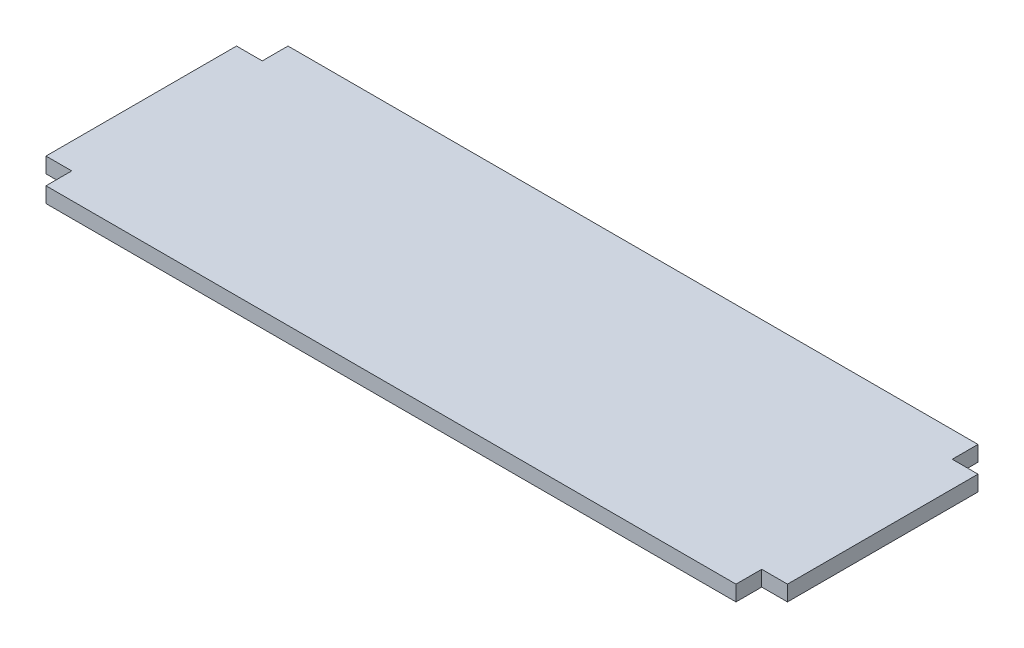
ISO-10303-21;
HEADER;
FILE_DESCRIPTION(('STEP AP214'),'2;1');
FILE_NAME('part.step','',(''),(''),'','','');
FILE_SCHEMA(('AUTOMOTIVE_DESIGN { 1 0 10303 214 1 1 1 1 }'));
ENDSEC;
DATA;
#1=APPLICATION_CONTEXT('core data for automotive mechanical design processes');
#2=APPLICATION_PROTOCOL_DEFINITION('international standard','automotive_design',2000,#1);
#3=PRODUCT_CONTEXT('',#1,'mechanical');
#4=PRODUCT('Part','Part','',(#3));
#5=PRODUCT_RELATED_PRODUCT_CATEGORY('part','',(#4));
#6=PRODUCT_DEFINITION_FORMATION('','',#4);
#7=PRODUCT_DEFINITION_CONTEXT('part definition',#1,'design');
#8=PRODUCT_DEFINITION('design','',#6,#7);
#9=PRODUCT_DEFINITION_SHAPE('','',#8);
#10=(LENGTH_UNIT() NAMED_UNIT(*) SI_UNIT(.MILLI.,.METRE.));
#11=(NAMED_UNIT(*) PLANE_ANGLE_UNIT() SI_UNIT($,.RADIAN.));
#12=(NAMED_UNIT(*) SI_UNIT($,.STERADIAN.) SOLID_ANGLE_UNIT());
#13=UNCERTAINTY_MEASURE_WITH_UNIT(LENGTH_MEASURE(1.E-05),#10,'distance_accuracy_value','');
#14=(GEOMETRIC_REPRESENTATION_CONTEXT(3) GLOBAL_UNCERTAINTY_ASSIGNED_CONTEXT((#13)) GLOBAL_UNIT_ASSIGNED_CONTEXT((#10,
#11,#12)) REPRESENTATION_CONTEXT('',''));
#15=CARTESIAN_POINT('',(0.,0.,0.));
#16=DIRECTION('',(0.,0.,1.));
#17=DIRECTION('',(1.,0.,0.));
#18=AXIS2_PLACEMENT_3D('',#15,#16,#17);
#19=CARTESIAN_POINT('',(278.,6.,-94.));
#20=DIRECTION('',(-1.,0.,0.));
#21=DIRECTION('',(0.,0.,1.));
#22=AXIS2_PLACEMENT_3D('',#19,#20,#21);
#23=PLANE('',#22);
#24=DIRECTION('',(0.,0.,-1.));
#25=VECTOR('',#24,1.);
#26=CARTESIAN_POINT('',(278.,0.,-94.));
#27=LINE('',#26,#25);
#28=CARTESIAN_POINT('',(278.,0.,-84.));
#29=VERTEX_POINT('',#28);
#30=CARTESIAN_POINT('',(278.,0.,-94.));
#31=VERTEX_POINT('',#30);
#32=EDGE_CURVE('E158',#29,#31,#27,.T.);
#33=ORIENTED_EDGE('',*,*,#32,.T.);
#34=DIRECTION('',(0.,-1.,0.));
#35=VECTOR('',#34,1.);
#36=CARTESIAN_POINT('',(278.,6.,-94.));
#37=LINE('',#36,#35);
#38=CARTESIAN_POINT('',(278.,6.,-94.));
#39=VERTEX_POINT('',#38);
#40=EDGE_CURVE('E11',#39,#31,#37,.T.);
#41=ORIENTED_EDGE('',*,*,#40,.F.);
#42=DIRECTION('',(0.,0.,-1.));
#43=VECTOR('',#42,1.);
#44=CARTESIAN_POINT('',(278.,6.,-94.));
#45=LINE('',#44,#43);
#46=CARTESIAN_POINT('',(278.,6.,-84.));
#47=VERTEX_POINT('',#46);
#48=EDGE_CURVE('E180',#47,#39,#45,.T.);
#49=ORIENTED_EDGE('',*,*,#48,.F.);
#50=DIRECTION('',(0.,-1.,0.));
#51=VECTOR('',#50,1.);
#52=CARTESIAN_POINT('',(278.,6.,-84.));
#53=LINE('',#52,#51);
#54=EDGE_CURVE('E154',#47,#29,#53,.T.);
#55=ORIENTED_EDGE('',*,*,#54,.T.);
#56=EDGE_LOOP('',(#33,#41,#49,#55));
#57=FACE_BOUND('',#56,.T.);
#58=ADVANCED_FACE('F38',(#57),#23,.F.);
#59=CARTESIAN_POINT('',(278.,6.,-94.));
#60=DIRECTION('',(0.,0.,1.));
#61=DIRECTION('',(1.,0.,0.));
#62=AXIS2_PLACEMENT_3D('',#59,#60,#61);
#63=PLANE('',#62);
#64=DIRECTION('',(-1.,0.,0.));
#65=VECTOR('',#64,1.);
#66=CARTESIAN_POINT('',(278.,0.,-94.));
#67=LINE('',#66,#65);
#68=CARTESIAN_POINT('',(10.,0.,-94.));
#69=VERTEX_POINT('',#68);
#70=EDGE_CURVE('E161',#31,#69,#67,.T.);
#71=ORIENTED_EDGE('',*,*,#70,.T.);
#72=DIRECTION('',(0.,-1.,0.));
#73=VECTOR('',#72,1.);
#74=CARTESIAN_POINT('',(10.,6.,-94.));
#75=LINE('',#74,#73);
#76=CARTESIAN_POINT('',(10.,6.,-94.));
#77=VERTEX_POINT('',#76);
#78=EDGE_CURVE('E46',#77,#69,#75,.T.);
#79=ORIENTED_EDGE('',*,*,#78,.F.);
#80=DIRECTION('',(-1.,0.,0.));
#81=VECTOR('',#80,1.);
#82=CARTESIAN_POINT('',(278.,6.,-94.));
#83=LINE('',#82,#81);
#84=EDGE_CURVE('E109',#39,#77,#83,.T.);
#85=ORIENTED_EDGE('',*,*,#84,.F.);
#86=ORIENTED_EDGE('',*,*,#40,.T.);
#87=EDGE_LOOP('',(#71,#79,#85,#86));
#88=FACE_BOUND('',#87,.T.);
#89=ADVANCED_FACE('F258',(#88),#63,.F.);
#90=CARTESIAN_POINT('',(10.,6.,-94.));
#91=DIRECTION('',(1.,0.,0.));
#92=DIRECTION('',(0.,0.,-1.));
#93=AXIS2_PLACEMENT_3D('',#90,#91,#92);
#94=PLANE('',#93);
#95=DIRECTION('',(0.,0.,1.));
#96=VECTOR('',#95,1.);
#97=CARTESIAN_POINT('',(10.,0.,-94.));
#98=LINE('',#97,#96);
#99=CARTESIAN_POINT('',(10.,0.,-84.));
#100=VERTEX_POINT('',#99);
#101=EDGE_CURVE('E163',#69,#100,#98,.T.);
#102=ORIENTED_EDGE('',*,*,#101,.T.);
#103=DIRECTION('',(0.,-1.,0.));
#104=VECTOR('',#103,1.);
#105=CARTESIAN_POINT('',(10.,6.,-84.));
#106=LINE('',#105,#104);
#107=CARTESIAN_POINT('',(10.,6.,-84.));
#108=VERTEX_POINT('',#107);
#109=EDGE_CURVE('E199',#108,#100,#106,.T.);
#110=ORIENTED_EDGE('',*,*,#109,.F.);
#111=DIRECTION('',(0.,0.,1.));
#112=VECTOR('',#111,1.);
#113=CARTESIAN_POINT('',(10.,6.,-94.));
#114=LINE('',#113,#112);
#115=EDGE_CURVE('E207',#77,#108,#114,.T.);
#116=ORIENTED_EDGE('',*,*,#115,.F.);
#117=ORIENTED_EDGE('',*,*,#78,.T.);
#118=EDGE_LOOP('',(#102,#110,#116,#117));
#119=FACE_BOUND('',#118,.T.);
#120=ADVANCED_FACE('F205',(#119),#94,.F.);
#121=CARTESIAN_POINT('',(0.,6.,-84.));
#122=DIRECTION('',(0.,0.,1.));
#123=DIRECTION('',(1.,0.,0.));
#124=AXIS2_PLACEMENT_3D('',#121,#122,#123);
#125=PLANE('',#124);
#126=DIRECTION('',(-1.,0.,0.));
#127=VECTOR('',#126,1.);
#128=CARTESIAN_POINT('',(0.,0.,-84.));
#129=LINE('',#128,#127);
#130=CARTESIAN_POINT('',(0.,0.,-84.));
#131=VERTEX_POINT('',#130);
#132=EDGE_CURVE('E165',#100,#131,#129,.T.);
#133=ORIENTED_EDGE('',*,*,#132,.T.);
#134=DIRECTION('',(0.,-1.,0.));
#135=VECTOR('',#134,1.);
#136=CARTESIAN_POINT('',(0.,6.,-84.));
#137=LINE('',#136,#135);
#138=CARTESIAN_POINT('',(0.,6.,-84.));
#139=VERTEX_POINT('',#138);
#140=EDGE_CURVE('E196',#139,#131,#137,.T.);
#141=ORIENTED_EDGE('',*,*,#140,.F.);
#142=DIRECTION('',(-1.,0.,0.));
#143=VECTOR('',#142,1.);
#144=CARTESIAN_POINT('',(0.,6.,-84.));
#145=LINE('',#144,#143);
#146=EDGE_CURVE('E225',#108,#139,#145,.T.);
#147=ORIENTED_EDGE('',*,*,#146,.F.);
#148=ORIENTED_EDGE('',*,*,#109,.T.);
#149=EDGE_LOOP('',(#133,#141,#147,#148));
#150=FACE_BOUND('',#149,.T.);
#151=ADVANCED_FACE('F216',(#150),#125,.F.);
#152=CARTESIAN_POINT('',(0.,6.,-84.));
#153=DIRECTION('',(1.,0.,0.));
#154=DIRECTION('',(0.,0.,-1.));
#155=AXIS2_PLACEMENT_3D('',#152,#153,#154);
#156=PLANE('',#155);
#157=DIRECTION('',(0.,0.,1.));
#158=VECTOR('',#157,1.);
#159=CARTESIAN_POINT('',(0.,0.,-84.));
#160=LINE('',#159,#158);
#161=CARTESIAN_POINT('',(0.,0.,-10.));
#162=VERTEX_POINT('',#161);
#163=EDGE_CURVE('E167',#131,#162,#160,.T.);
#164=ORIENTED_EDGE('',*,*,#163,.T.);
#165=DIRECTION('',(0.,-1.,0.));
#166=VECTOR('',#165,1.);
#167=CARTESIAN_POINT('',(0.,6.,-10.));
#168=LINE('',#167,#166);
#169=CARTESIAN_POINT('',(0.,6.,-10.));
#170=VERTEX_POINT('',#169);
#171=EDGE_CURVE('E193',#170,#162,#168,.T.);
#172=ORIENTED_EDGE('',*,*,#171,.F.);
#173=DIRECTION('',(0.,0.,1.));
#174=VECTOR('',#173,1.);
#175=CARTESIAN_POINT('',(0.,6.,-84.));
#176=LINE('',#175,#174);
#177=EDGE_CURVE('E222',#139,#170,#176,.T.);
#178=ORIENTED_EDGE('',*,*,#177,.F.);
#179=ORIENTED_EDGE('',*,*,#140,.T.);
#180=EDGE_LOOP('',(#164,#172,#178,#179));
#181=FACE_BOUND('',#180,.T.);
#182=ADVANCED_FACE('F220',(#181),#156,.F.);
#183=CARTESIAN_POINT('',(0.,6.,-10.));
#184=DIRECTION('',(0.,0.,-1.));
#185=DIRECTION('',(-1.,0.,0.));
#186=AXIS2_PLACEMENT_3D('',#183,#184,#185);
#187=PLANE('',#186);
#188=DIRECTION('',(1.,0.,0.));
#189=VECTOR('',#188,1.);
#190=CARTESIAN_POINT('',(0.,0.,-10.));
#191=LINE('',#190,#189);
#192=CARTESIAN_POINT('',(10.,0.,-10.));
#193=VERTEX_POINT('',#192);
#194=EDGE_CURVE('E169',#162,#193,#191,.T.);
#195=ORIENTED_EDGE('',*,*,#194,.T.);
#196=DIRECTION('',(0.,-1.,0.));
#197=VECTOR('',#196,1.);
#198=CARTESIAN_POINT('',(10.,6.,-10.));
#199=LINE('',#198,#197);
#200=CARTESIAN_POINT('',(10.,6.,-10.));
#201=VERTEX_POINT('',#200);
#202=EDGE_CURVE('E190',#201,#193,#199,.T.);
#203=ORIENTED_EDGE('',*,*,#202,.F.);
#204=DIRECTION('',(1.,0.,0.));
#205=VECTOR('',#204,1.);
#206=CARTESIAN_POINT('',(0.,6.,-10.));
#207=LINE('',#206,#205);
#208=EDGE_CURVE('E224',#170,#201,#207,.T.);
#209=ORIENTED_EDGE('',*,*,#208,.F.);
#210=ORIENTED_EDGE('',*,*,#171,.T.);
#211=EDGE_LOOP('',(#195,#203,#209,#210));
#212=FACE_BOUND('',#211,.T.);
#213=ADVANCED_FACE('F271',(#212),#187,.F.);
#214=CARTESIAN_POINT('',(10.,6.,0.));
#215=DIRECTION('',(1.,0.,0.));
#216=DIRECTION('',(0.,0.,-1.));
#217=AXIS2_PLACEMENT_3D('',#214,#215,#216);
#218=PLANE('',#217);
#219=DIRECTION('',(0.,0.,1.));
#220=VECTOR('',#219,1.);
#221=CARTESIAN_POINT('',(10.,0.,0.));
#222=LINE('',#221,#220);
#223=CARTESIAN_POINT('',(10.,0.,0.));
#224=VERTEX_POINT('',#223);
#225=EDGE_CURVE('E171',#193,#224,#222,.T.);
#226=ORIENTED_EDGE('',*,*,#225,.T.);
#227=DIRECTION('',(0.,-1.,0.));
#228=VECTOR('',#227,1.);
#229=CARTESIAN_POINT('',(10.,6.,0.));
#230=LINE('',#229,#228);
#231=CARTESIAN_POINT('',(10.,6.,0.));
#232=VERTEX_POINT('',#231);
#233=EDGE_CURVE('E187',#232,#224,#230,.T.);
#234=ORIENTED_EDGE('',*,*,#233,.F.);
#235=DIRECTION('',(0.,0.,1.));
#236=VECTOR('',#235,1.);
#237=CARTESIAN_POINT('',(10.,6.,0.));
#238=LINE('',#237,#236);
#239=EDGE_CURVE('E227',#201,#232,#238,.T.);
#240=ORIENTED_EDGE('',*,*,#239,.F.);
#241=ORIENTED_EDGE('',*,*,#202,.T.);
#242=EDGE_LOOP('',(#226,#234,#240,#241));
#243=FACE_BOUND('',#242,.T.);
#244=ADVANCED_FACE('F274',(#243),#218,.F.);
#245=CARTESIAN_POINT('',(278.,6.,0.));
#246=DIRECTION('',(0.,0.,-1.));
#247=DIRECTION('',(-1.,0.,0.));
#248=AXIS2_PLACEMENT_3D('',#245,#246,#247);
#249=PLANE('',#248);
#250=DIRECTION('',(1.,0.,0.));
#251=VECTOR('',#250,1.);
#252=CARTESIAN_POINT('',(278.,0.,0.));
#253=LINE('',#252,#251);
#254=CARTESIAN_POINT('',(278.,0.,0.));
#255=VERTEX_POINT('',#254);
#256=EDGE_CURVE('E173',#224,#255,#253,.T.);
#257=ORIENTED_EDGE('',*,*,#256,.T.);
#258=DIRECTION('',(0.,-1.,0.));
#259=VECTOR('',#258,1.);
#260=CARTESIAN_POINT('',(278.,6.,0.));
#261=LINE('',#260,#259);
#262=CARTESIAN_POINT('',(278.,6.,0.));
#263=VERTEX_POINT('',#262);
#264=EDGE_CURVE('E184',#263,#255,#261,.T.);
#265=ORIENTED_EDGE('',*,*,#264,.F.);
#266=DIRECTION('',(1.,0.,0.));
#267=VECTOR('',#266,1.);
#268=CARTESIAN_POINT('',(278.,6.,0.));
#269=LINE('',#268,#267);
#270=EDGE_CURVE('E233',#232,#263,#269,.T.);
#271=ORIENTED_EDGE('',*,*,#270,.F.);
#272=ORIENTED_EDGE('',*,*,#233,.T.);
#273=EDGE_LOOP('',(#257,#265,#271,#272));
#274=FACE_BOUND('',#273,.T.);
#275=ADVANCED_FACE('F239',(#274),#249,.F.);
#276=CARTESIAN_POINT('',(278.,6.,0.));
#277=DIRECTION('',(-1.,0.,0.));
#278=DIRECTION('',(0.,0.,1.));
#279=AXIS2_PLACEMENT_3D('',#276,#277,#278);
#280=PLANE('',#279);
#281=DIRECTION('',(0.,0.,-1.));
#282=VECTOR('',#281,1.);
#283=CARTESIAN_POINT('',(278.,0.,0.));
#284=LINE('',#283,#282);
#285=CARTESIAN_POINT('',(278.,0.,-10.));
#286=VERTEX_POINT('',#285);
#287=EDGE_CURVE('E175',#255,#286,#284,.T.);
#288=ORIENTED_EDGE('',*,*,#287,.T.);
#289=DIRECTION('',(0.,-1.,0.));
#290=VECTOR('',#289,1.);
#291=CARTESIAN_POINT('',(278.,6.,-10.));
#292=LINE('',#291,#290);
#293=CARTESIAN_POINT('',(278.,6.,-10.));
#294=VERTEX_POINT('',#293);
#295=EDGE_CURVE('E149',#294,#286,#292,.T.);
#296=ORIENTED_EDGE('',*,*,#295,.F.);
#297=DIRECTION('',(0.,0.,-1.));
#298=VECTOR('',#297,1.);
#299=CARTESIAN_POINT('',(278.,6.,0.));
#300=LINE('',#299,#298);
#301=EDGE_CURVE('E140',#263,#294,#300,.T.);
#302=ORIENTED_EDGE('',*,*,#301,.F.);
#303=ORIENTED_EDGE('',*,*,#264,.T.);
#304=EDGE_LOOP('',(#288,#296,#302,#303));
#305=FACE_BOUND('',#304,.T.);
#306=ADVANCED_FACE('F243',(#305),#280,.F.);
#307=CARTESIAN_POINT('',(288.,6.,-10.));
#308=DIRECTION('',(0.,0.,-1.));
#309=DIRECTION('',(-1.,0.,0.));
#310=AXIS2_PLACEMENT_3D('',#307,#308,#309);
#311=PLANE('',#310);
#312=DIRECTION('',(1.,0.,0.));
#313=VECTOR('',#312,1.);
#314=CARTESIAN_POINT('',(288.,0.,-10.));
#315=LINE('',#314,#313);
#316=CARTESIAN_POINT('',(288.,0.,-10.));
#317=VERTEX_POINT('',#316);
#318=EDGE_CURVE('E148',#286,#317,#315,.T.);
#319=ORIENTED_EDGE('',*,*,#318,.T.);
#320=DIRECTION('',(0.,-1.,0.));
#321=VECTOR('',#320,1.);
#322=CARTESIAN_POINT('',(288.,6.,-10.));
#323=LINE('',#322,#321);
#324=CARTESIAN_POINT('',(288.,6.,-10.));
#325=VERTEX_POINT('',#324);
#326=EDGE_CURVE('E145',#325,#317,#323,.T.);
#327=ORIENTED_EDGE('',*,*,#326,.F.);
#328=DIRECTION('',(1.,0.,0.));
#329=VECTOR('',#328,1.);
#330=CARTESIAN_POINT('',(288.,6.,-10.));
#331=LINE('',#330,#329);
#332=EDGE_CURVE('E134',#294,#325,#331,.T.);
#333=ORIENTED_EDGE('',*,*,#332,.F.);
#334=ORIENTED_EDGE('',*,*,#295,.T.);
#335=EDGE_LOOP('',(#319,#327,#333,#334));
#336=FACE_BOUND('',#335,.T.);
#337=ADVANCED_FACE('F146',(#336),#311,.F.);
#338=CARTESIAN_POINT('',(288.,6.,-84.));
#339=DIRECTION('',(-1.,0.,0.));
#340=DIRECTION('',(0.,0.,1.));
#341=AXIS2_PLACEMENT_3D('',#338,#339,#340);
#342=PLANE('',#341);
#343=DIRECTION('',(0.,0.,-1.));
#344=VECTOR('',#343,1.);
#345=CARTESIAN_POINT('',(288.,0.,-84.));
#346=LINE('',#345,#344);
#347=CARTESIAN_POINT('',(288.,0.,-84.));
#348=VERTEX_POINT('',#347);
#349=EDGE_CURVE('E95',#317,#348,#346,.T.);
#350=ORIENTED_EDGE('',*,*,#349,.T.);
#351=DIRECTION('',(0.,-1.,0.));
#352=VECTOR('',#351,1.);
#353=CARTESIAN_POINT('',(288.,6.,-84.));
#354=LINE('',#353,#352);
#355=CARTESIAN_POINT('',(288.,6.,-84.));
#356=VERTEX_POINT('',#355);
#357=EDGE_CURVE('E150',#356,#348,#354,.T.);
#358=ORIENTED_EDGE('',*,*,#357,.F.);
#359=DIRECTION('',(0.,0.,-1.));
#360=VECTOR('',#359,1.);
#361=CARTESIAN_POINT('',(288.,6.,-84.));
#362=LINE('',#361,#360);
#363=EDGE_CURVE('E138',#325,#356,#362,.T.);
#364=ORIENTED_EDGE('',*,*,#363,.F.);
#365=ORIENTED_EDGE('',*,*,#326,.T.);
#366=EDGE_LOOP('',(#350,#358,#364,#365));
#367=FACE_BOUND('',#366,.T.);
#368=ADVANCED_FACE('F152',(#367),#342,.F.);
#369=CARTESIAN_POINT('',(288.,6.,-84.));
#370=DIRECTION('',(0.,0.,1.));
#371=DIRECTION('',(1.,0.,0.));
#372=AXIS2_PLACEMENT_3D('',#369,#370,#371);
#373=PLANE('',#372);
#374=DIRECTION('',(-1.,0.,0.));
#375=VECTOR('',#374,1.);
#376=CARTESIAN_POINT('',(288.,0.,-84.));
#377=LINE('',#376,#375);
#378=EDGE_CURVE('E101',#348,#29,#377,.T.);
#379=ORIENTED_EDGE('',*,*,#378,.T.);
#380=ORIENTED_EDGE('',*,*,#54,.F.);
#381=DIRECTION('',(-1.,0.,0.));
#382=VECTOR('',#381,1.);
#383=CARTESIAN_POINT('',(288.,6.,-84.));
#384=LINE('',#383,#382);
#385=EDGE_CURVE('E54',#356,#47,#384,.T.);
#386=ORIENTED_EDGE('',*,*,#385,.F.);
#387=ORIENTED_EDGE('',*,*,#357,.T.);
#388=EDGE_LOOP('',(#379,#380,#386,#387));
#389=FACE_BOUND('',#388,.T.);
#390=ADVANCED_FACE('F247',(#389),#373,.F.);
#391=CARTESIAN_POINT('',(0.,6.,0.));
#392=DIRECTION('',(0.,-1.,0.));
#393=DIRECTION('',(0.,0.,-1.));
#394=AXIS2_PLACEMENT_3D('',#391,#392,#393);
#395=PLANE('',#394);
#396=ORIENTED_EDGE('',*,*,#48,.T.);
#397=ORIENTED_EDGE('',*,*,#84,.T.);
#398=ORIENTED_EDGE('',*,*,#115,.T.);
#399=ORIENTED_EDGE('',*,*,#146,.T.);
#400=ORIENTED_EDGE('',*,*,#177,.T.);
#401=ORIENTED_EDGE('',*,*,#208,.T.);
#402=ORIENTED_EDGE('',*,*,#239,.T.);
#403=ORIENTED_EDGE('',*,*,#270,.T.);
#404=ORIENTED_EDGE('',*,*,#301,.T.);
#405=ORIENTED_EDGE('',*,*,#332,.T.);
#406=ORIENTED_EDGE('',*,*,#363,.T.);
#407=ORIENTED_EDGE('',*,*,#385,.T.);
#408=EDGE_LOOP('',(#396,#397,#398,#399,#400,#401,#402,#403,#404,#405,#406,#407));
#409=FACE_BOUND('',#408,.T.);
#410=ADVANCED_FACE('F136',(#409),#395,.F.);
#411=CARTESIAN_POINT('',(0.,0.,0.));
#412=DIRECTION('',(0.,-1.,0.));
#413=DIRECTION('',(0.,0.,-1.));
#414=AXIS2_PLACEMENT_3D('',#411,#412,#413);
#415=PLANE('',#414);
#416=ORIENTED_EDGE('',*,*,#32,.F.);
#417=ORIENTED_EDGE('',*,*,#378,.F.);
#418=ORIENTED_EDGE('',*,*,#349,.F.);
#419=ORIENTED_EDGE('',*,*,#318,.F.);
#420=ORIENTED_EDGE('',*,*,#287,.F.);
#421=ORIENTED_EDGE('',*,*,#256,.F.);
#422=ORIENTED_EDGE('',*,*,#225,.F.);
#423=ORIENTED_EDGE('',*,*,#194,.F.);
#424=ORIENTED_EDGE('',*,*,#163,.F.);
#425=ORIENTED_EDGE('',*,*,#132,.F.);
#426=ORIENTED_EDGE('',*,*,#101,.F.);
#427=ORIENTED_EDGE('',*,*,#70,.F.);
#428=EDGE_LOOP('',(#416,#417,#418,#419,#420,#421,#422,#423,#424,#425,#426,#427));
#429=FACE_BOUND('',#428,.T.);
#430=ADVANCED_FACE('F211',(#429),#415,.T.);
#431=CLOSED_SHELL('',(#58,#89,#120,#151,#182,#213,#244,#275,#306,#337,#368,#390,#410,#430));
#432=MANIFOLD_SOLID_BREP('B2',#431);
#433=ADVANCED_BREP_SHAPE_REPRESENTATION('',(#18,#432),#14);
#434=SHAPE_DEFINITION_REPRESENTATION(#9,#433);
ENDSEC;
END-ISO-10303-21;
